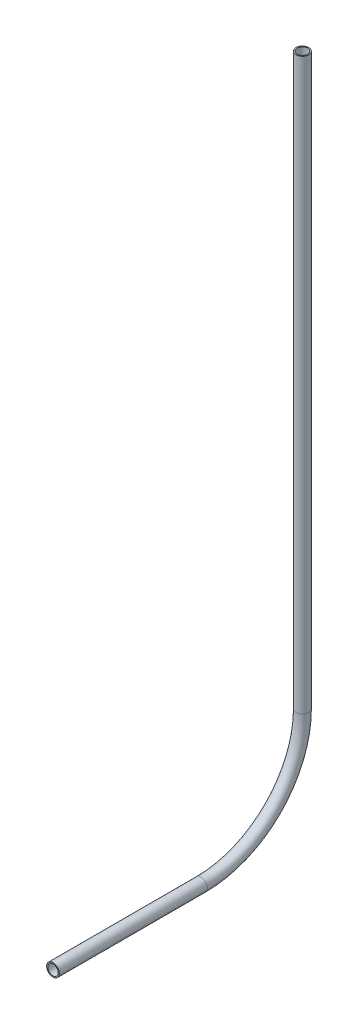
ISO-10303-21;
HEADER;
FILE_DESCRIPTION(('STEP AP214'),'2;1');
FILE_NAME('part.step','',(''),(''),'','','');
FILE_SCHEMA(('AUTOMOTIVE_DESIGN { 1 0 10303 214 1 1 1 1 }'));
ENDSEC;
DATA;
#1=APPLICATION_CONTEXT('core data for automotive mechanical design processes');
#2=APPLICATION_PROTOCOL_DEFINITION('international standard','automotive_design',2000,#1);
#3=PRODUCT_CONTEXT('',#1,'mechanical');
#4=PRODUCT('Part','Part','',(#3));
#5=PRODUCT_RELATED_PRODUCT_CATEGORY('part','',(#4));
#6=PRODUCT_DEFINITION_FORMATION('','',#4);
#7=PRODUCT_DEFINITION_CONTEXT('part definition',#1,'design');
#8=PRODUCT_DEFINITION('design','',#6,#7);
#9=PRODUCT_DEFINITION_SHAPE('','',#8);
#10=(LENGTH_UNIT() NAMED_UNIT(*) SI_UNIT(.MILLI.,.METRE.));
#11=(NAMED_UNIT(*) PLANE_ANGLE_UNIT() SI_UNIT($,.RADIAN.));
#12=(NAMED_UNIT(*) SI_UNIT($,.STERADIAN.) SOLID_ANGLE_UNIT());
#13=UNCERTAINTY_MEASURE_WITH_UNIT(LENGTH_MEASURE(1.E-05),#10,'distance_accuracy_value','');
#14=(GEOMETRIC_REPRESENTATION_CONTEXT(3) GLOBAL_UNCERTAINTY_ASSIGNED_CONTEXT((#13)) GLOBAL_UNIT_ASSIGNED_CONTEXT((#10,
#11,#12)) REPRESENTATION_CONTEXT('',''));
#15=CARTESIAN_POINT('',(0.,0.,0.));
#16=DIRECTION('',(0.,0.,1.));
#17=DIRECTION('',(1.,0.,0.));
#18=AXIS2_PLACEMENT_3D('',#15,#16,#17);
#19=CARTESIAN_POINT('',(0.,164.683893963399,57.9209503694831));
#20=DIRECTION('',(0.,0.,1.));
#21=DIRECTION('',(1.,0.,0.));
#22=AXIS2_PLACEMENT_3D('',#19,#20,#21);
#23=CYLINDRICAL_SURFACE('',#22,2.61619999999999);
#24=CARTESIAN_POINT('',(0.,164.683893963399,132.104570696891));
#25=DIRECTION('',(0.,0.,-1.));
#26=DIRECTION('',(-1.,0.,0.));
#27=AXIS2_PLACEMENT_3D('',#24,#25,#26);
#28=CIRCLE('',#27,2.61619999999999);
#29=CARTESIAN_POINT('',(-2.61619999999999,164.683893963399,132.104570696891));
#30=VERTEX_POINT('',#29);
#31=EDGE_CURVE('E55',#30,#30,#28,.T.);
#32=ORIENTED_EDGE('',*,*,#31,.F.);
#33=EDGE_LOOP('',(#32));
#34=FACE_BOUND('',#33,.T.);
#35=CARTESIAN_POINT('',(0.,164.683893963399,57.9209503694831));
#36=DIRECTION('',(0.,0.,-1.));
#37=DIRECTION('',(-1.,0.,0.));
#38=AXIS2_PLACEMENT_3D('',#35,#36,#37);
#39=CIRCLE('',#38,2.61619999999999);
#40=CARTESIAN_POINT('',(-2.61619999999999,164.683893963399,57.9209503694831));
#41=VERTEX_POINT('',#40);
#42=EDGE_CURVE('E51',#41,#41,#39,.T.);
#43=ORIENTED_EDGE('',*,*,#42,.T.);
#44=EDGE_LOOP('',(#43));
#45=FACE_BOUND('',#44,.T.);
#46=ADVANCED_FACE('F47',(#34,#45),#23,.F.);
#47=CARTESIAN_POINT('',(0.,164.683893963399,57.9209503694831));
#48=DIRECTION('',(0.,0.,1.));
#49=DIRECTION('',(1.,0.,0.));
#50=AXIS2_PLACEMENT_3D('',#47,#48,#49);
#51=CYLINDRICAL_SURFACE('',#50,3.175);
#52=CARTESIAN_POINT('',(0.,164.683893963399,132.104570696891));
#53=DIRECTION('',(0.,0.,-1.));
#54=DIRECTION('',(-1.,0.,0.));
#55=AXIS2_PLACEMENT_3D('',#52,#53,#54);
#56=CIRCLE('',#55,3.175);
#57=CARTESIAN_POINT('',(-3.175,164.683893963399,132.104570696891));
#58=VERTEX_POINT('',#57);
#59=EDGE_CURVE('E59',#58,#58,#56,.T.);
#60=ORIENTED_EDGE('',*,*,#59,.T.);
#61=EDGE_LOOP('',(#60));
#62=FACE_BOUND('',#61,.T.);
#63=CARTESIAN_POINT('',(0.,164.683893963399,57.9209503694831));
#64=DIRECTION('',(0.,0.,-1.));
#65=DIRECTION('',(-1.,0.,0.));
#66=AXIS2_PLACEMENT_3D('',#63,#64,#65);
#67=CIRCLE('',#66,3.175);
#68=CARTESIAN_POINT('',(-3.175,164.683893963399,57.9209503694831));
#69=VERTEX_POINT('',#68);
#70=EDGE_CURVE('E12',#69,#69,#67,.T.);
#71=ORIENTED_EDGE('',*,*,#70,.F.);
#72=EDGE_LOOP('',(#71));
#73=FACE_BOUND('',#72,.T.);
#74=ADVANCED_FACE('F74',(#62,#73),#51,.T.);
#75=CARTESIAN_POINT('',(0.,164.683893963399,132.104570696891));
#76=DIRECTION('',(0.,0.,-1.));
#77=DIRECTION('',(-1.,0.,0.));
#78=AXIS2_PLACEMENT_3D('',#75,#76,#77);
#79=PLANE('',#78);
#80=ORIENTED_EDGE('',*,*,#31,.T.);
#81=EDGE_LOOP('',(#80));
#82=FACE_BOUND('',#81,.T.);
#83=ORIENTED_EDGE('',*,*,#59,.F.);
#84=EDGE_LOOP('',(#83));
#85=FACE_BOUND('',#84,.T.);
#86=ADVANCED_FACE('F70',(#82,#85),#79,.F.);
#87=CARTESIAN_POINT('',(0.,164.683893963399,57.9209503694831));
#88=DIRECTION('',(0.,0.,-1.));
#89=DIRECTION('',(-1.,0.,0.));
#90=AXIS2_PLACEMENT_3D('',#87,#88,#89);
#91=PLANE('',#90);
#92=ORIENTED_EDGE('',*,*,#42,.F.);
#93=EDGE_LOOP('',(#92));
#94=FACE_BOUND('',#93,.T.);
#95=ORIENTED_EDGE('',*,*,#70,.T.);
#96=EDGE_LOOP('',(#95));
#97=FACE_BOUND('',#96,.T.);
#98=ADVANCED_FACE('F49',(#94,#97),#91,.T.);
#99=CLOSED_SHELL('',(#46,#74,#86,#98));
#100=MANIFOLD_SOLID_BREP('B2',#99);
#101=CARTESIAN_POINT('',(0.,215.483893963399,57.9209503694831));
#102=DIRECTION('',(-1.,0.,0.));
#103=DIRECTION('',(0.,0.,1.));
#104=AXIS2_PLACEMENT_3D('',#101,#102,#103);
#105=TOROIDAL_SURFACE('',#104,50.8,2.61619999999999);
#106=CARTESIAN_POINT('',(0.,215.483893963399,7.1209503694831));
#107=DIRECTION('',(0.,1.,0.));
#108=DIRECTION('',(0.,0.,1.));
#109=AXIS2_PLACEMENT_3D('',#106,#107,#108);
#110=CIRCLE('',#109,2.61619999999999);
#111=CARTESIAN_POINT('',(0.,215.483893963399,4.50475036948311));
#112=VERTEX_POINT('',#111);
#113=EDGE_CURVE('E150',#112,#112,#110,.T.);
#114=CARTESIAN_POINT('',(0.,164.683893963399,57.9209503694831));
#115=DIRECTION('',(0.,0.,1.));
#116=DIRECTION('',(1.,0.,0.));
#117=AXIS2_PLACEMENT_3D('',#114,#115,#116);
#118=CIRCLE('',#117,2.61619999999999);
#119=CARTESIAN_POINT('',(0.,162.067693963399,57.9209503694831));
#120=VERTEX_POINT('',#119);
#121=EDGE_CURVE('E140',#120,#120,#118,.T.);
#122=CARTESIAN_POINT('',(0.,215.483893963399,57.9209503694831));
#123=DIRECTION('',(-1.,0.,0.));
#124=DIRECTION('',(0.,0.,1.));
#125=AXIS2_PLACEMENT_3D('',#122,#123,#124);
#126=CIRCLE('',#125,53.4162);
#127=EDGE_CURVE('',#112,#120,#126,.T.);
#128=ORIENTED_EDGE('',*,*,#113,.T.);
#129=ORIENTED_EDGE('',*,*,#121,.T.);
#130=ORIENTED_EDGE('',*,*,#127,.T.);
#131=ORIENTED_EDGE('',*,*,#127,.F.);
#132=EDGE_LOOP('',(#128,#130,#129,#131));
#133=FACE_BOUND('',#132,.T.);
#134=ADVANCED_FACE('F136',(#133),#105,.F.);
#135=CARTESIAN_POINT('',(0.,215.483893963399,57.9209503694831));
#136=DIRECTION('',(-1.,0.,0.));
#137=DIRECTION('',(0.,0.,1.));
#138=AXIS2_PLACEMENT_3D('',#135,#136,#137);
#139=TOROIDAL_SURFACE('',#138,50.8,3.175);
#140=CARTESIAN_POINT('',(0.,215.483893963399,7.1209503694831));
#141=DIRECTION('',(0.,1.,0.));
#142=DIRECTION('',(0.,0.,1.));
#143=AXIS2_PLACEMENT_3D('',#140,#141,#142);
#144=CIRCLE('',#143,3.175);
#145=CARTESIAN_POINT('',(0.,215.483893963399,3.9459503694831));
#146=VERTEX_POINT('',#145);
#147=EDGE_CURVE('E144',#146,#146,#144,.T.);
#148=CARTESIAN_POINT('',(0.,164.683893963399,57.9209503694831));
#149=DIRECTION('',(0.,0.,1.));
#150=DIRECTION('',(1.,0.,0.));
#151=AXIS2_PLACEMENT_3D('',#148,#149,#150);
#152=CIRCLE('',#151,3.175);
#153=CARTESIAN_POINT('',(0.,161.508893963399,57.9209503694831));
#154=VERTEX_POINT('',#153);
#155=EDGE_CURVE('E46',#154,#154,#152,.T.);
#156=CARTESIAN_POINT('',(0.,215.483893963399,57.9209503694831));
#157=DIRECTION('',(-1.,0.,0.));
#158=DIRECTION('',(0.,0.,1.));
#159=AXIS2_PLACEMENT_3D('',#156,#157,#158);
#160=CIRCLE('',#159,53.975);
#161=EDGE_CURVE('',#146,#154,#160,.T.);
#162=ORIENTED_EDGE('',*,*,#147,.F.);
#163=ORIENTED_EDGE('',*,*,#155,.F.);
#164=ORIENTED_EDGE('',*,*,#161,.T.);
#165=ORIENTED_EDGE('',*,*,#161,.F.);
#166=EDGE_LOOP('',(#162,#164,#163,#165));
#167=FACE_BOUND('',#166,.T.);
#168=ADVANCED_FACE('F163',(#167),#139,.T.);
#169=CARTESIAN_POINT('',(0.,215.483893963399,7.12095036948312));
#170=DIRECTION('',(0.,1.,0.));
#171=DIRECTION('',(0.,0.,1.));
#172=AXIS2_PLACEMENT_3D('',#169,#170,#171);
#173=PLANE('',#172);
#174=ORIENTED_EDGE('',*,*,#113,.F.);
#175=EDGE_LOOP('',(#174));
#176=FACE_BOUND('',#175,.T.);
#177=ORIENTED_EDGE('',*,*,#147,.T.);
#178=EDGE_LOOP('',(#177));
#179=FACE_BOUND('',#178,.T.);
#180=ADVANCED_FACE('F159',(#176,#179),#173,.T.);
#181=CARTESIAN_POINT('',(0.,164.683893963399,57.9209503694831));
#182=DIRECTION('',(0.,0.,1.));
#183=DIRECTION('',(1.,0.,0.));
#184=AXIS2_PLACEMENT_3D('',#181,#182,#183);
#185=PLANE('',#184);
#186=ORIENTED_EDGE('',*,*,#121,.F.);
#187=EDGE_LOOP('',(#186));
#188=FACE_BOUND('',#187,.T.);
#189=ORIENTED_EDGE('',*,*,#155,.T.);
#190=EDGE_LOOP('',(#189));
#191=FACE_BOUND('',#190,.T.);
#192=ADVANCED_FACE('F138',(#188,#191),#185,.T.);
#193=CLOSED_SHELL('',(#134,#168,#180,#192));
#194=MANIFOLD_SOLID_BREP('B7',#193);
#195=CARTESIAN_POINT('',(0.,500.823219170173,7.12095036948313));
#196=DIRECTION('',(0.,-1.,0.));
#197=DIRECTION('',(0.,0.,-1.));
#198=AXIS2_PLACEMENT_3D('',#195,#196,#197);
#199=CYLINDRICAL_SURFACE('',#198,2.61619999999999);
#200=CARTESIAN_POINT('',(0.,500.823219170173,7.12095036948313));
#201=DIRECTION('',(0.,1.,0.));
#202=DIRECTION('',(-1.,0.,0.));
#203=AXIS2_PLACEMENT_3D('',#200,#201,#202);
#204=CIRCLE('',#203,2.61619999999999);
#205=CARTESIAN_POINT('',(-2.61619999999999,500.823219170173,7.12095036948313));
#206=VERTEX_POINT('',#205);
#207=EDGE_CURVE('E234',#206,#206,#204,.T.);
#208=ORIENTED_EDGE('',*,*,#207,.T.);
#209=EDGE_LOOP('',(#208));
#210=FACE_BOUND('',#209,.T.);
#211=CARTESIAN_POINT('',(0.,215.483893963399,7.12095036948313));
#212=DIRECTION('',(0.,-1.,0.));
#213=DIRECTION('',(0.,0.,-1.));
#214=AXIS2_PLACEMENT_3D('',#211,#212,#213);
#215=CIRCLE('',#214,2.61619999999999);
#216=CARTESIAN_POINT('',(0.,215.483893963399,4.50475036948314));
#217=VERTEX_POINT('',#216);
#218=EDGE_CURVE('E224',#217,#217,#215,.T.);
#219=ORIENTED_EDGE('',*,*,#218,.T.);
#220=EDGE_LOOP('',(#219));
#221=FACE_BOUND('',#220,.T.);
#222=ADVANCED_FACE('F220',(#210,#221),#199,.F.);
#223=CARTESIAN_POINT('',(0.,500.823219170173,7.12095036948313));
#224=DIRECTION('',(0.,-1.,0.));
#225=DIRECTION('',(0.,0.,-1.));
#226=AXIS2_PLACEMENT_3D('',#223,#224,#225);
#227=CYLINDRICAL_SURFACE('',#226,3.175);
#228=CARTESIAN_POINT('',(0.,500.823219170173,7.12095036948313));
#229=DIRECTION('',(0.,1.,0.));
#230=DIRECTION('',(-1.,0.,0.));
#231=AXIS2_PLACEMENT_3D('',#228,#229,#230);
#232=CIRCLE('',#231,3.175);
#233=CARTESIAN_POINT('',(-3.175,500.823219170173,7.12095036948313));
#234=VERTEX_POINT('',#233);
#235=EDGE_CURVE('E228',#234,#234,#232,.T.);
#236=ORIENTED_EDGE('',*,*,#235,.F.);
#237=EDGE_LOOP('',(#236));
#238=FACE_BOUND('',#237,.T.);
#239=CARTESIAN_POINT('',(0.,215.483893963399,7.12095036948313));
#240=DIRECTION('',(0.,-1.,0.));
#241=DIRECTION('',(0.,0.,-1.));
#242=AXIS2_PLACEMENT_3D('',#239,#240,#241);
#243=CIRCLE('',#242,3.175);
#244=CARTESIAN_POINT('',(0.,215.483893963399,3.94595036948313));
#245=VERTEX_POINT('',#244);
#246=EDGE_CURVE('E135',#245,#245,#243,.T.);
#247=ORIENTED_EDGE('',*,*,#246,.F.);
#248=EDGE_LOOP('',(#247));
#249=FACE_BOUND('',#248,.T.);
#250=ADVANCED_FACE('F247',(#238,#249),#227,.T.);
#251=CARTESIAN_POINT('',(0.,500.823219170173,7.12095036948313));
#252=DIRECTION('',(0.,1.,0.));
#253=DIRECTION('',(-1.,0.,0.));
#254=AXIS2_PLACEMENT_3D('',#251,#252,#253);
#255=PLANE('',#254);
#256=ORIENTED_EDGE('',*,*,#207,.F.);
#257=EDGE_LOOP('',(#256));
#258=FACE_BOUND('',#257,.T.);
#259=ORIENTED_EDGE('',*,*,#235,.T.);
#260=EDGE_LOOP('',(#259));
#261=FACE_BOUND('',#260,.T.);
#262=ADVANCED_FACE('F243',(#258,#261),#255,.T.);
#263=CARTESIAN_POINT('',(0.,215.483893963399,7.12095036948312));
#264=DIRECTION('',(0.,-1.,0.));
#265=DIRECTION('',(0.,0.,-1.));
#266=AXIS2_PLACEMENT_3D('',#263,#264,#265);
#267=PLANE('',#266);
#268=ORIENTED_EDGE('',*,*,#218,.F.);
#269=EDGE_LOOP('',(#268));
#270=FACE_BOUND('',#269,.T.);
#271=ORIENTED_EDGE('',*,*,#246,.T.);
#272=EDGE_LOOP('',(#271));
#273=FACE_BOUND('',#272,.T.);
#274=ADVANCED_FACE('F222',(#270,#273),#267,.T.);
#275=CLOSED_SHELL('',(#222,#250,#262,#274));
#276=MANIFOLD_SOLID_BREP('B41',#275);
#277=ADVANCED_BREP_SHAPE_REPRESENTATION('',(#18,#100,#194,#276),#14);
#278=SHAPE_DEFINITION_REPRESENTATION(#9,#277);
ENDSEC;
END-ISO-10303-21;
